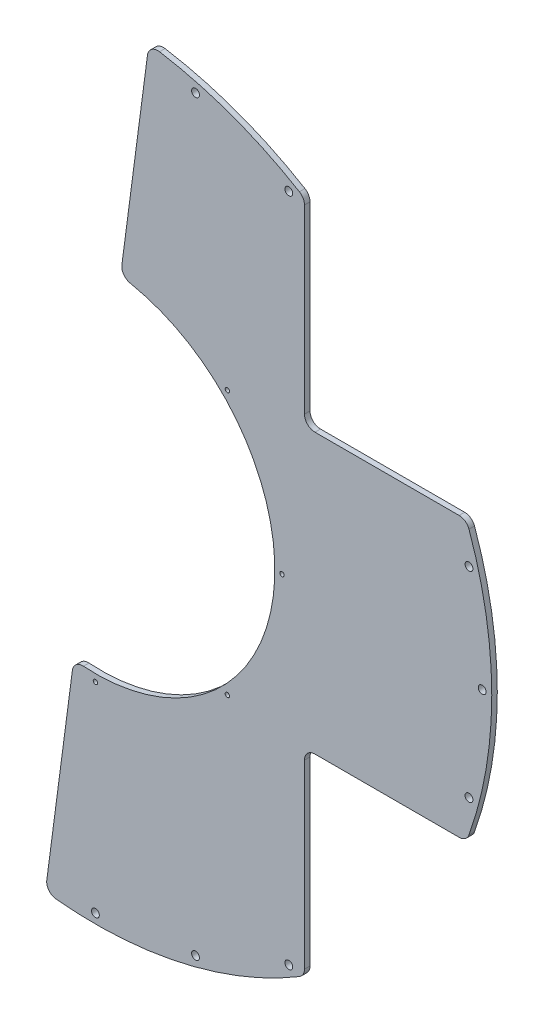
ISO-10303-21;
HEADER;
FILE_DESCRIPTION(('STEP AP214'),'2;1');
FILE_NAME('part.step','',(''),(''),'','','');
FILE_SCHEMA(('AUTOMOTIVE_DESIGN { 1 0 10303 214 1 1 1 1 }'));
ENDSEC;
DATA;
#1=APPLICATION_CONTEXT('core data for automotive mechanical design processes');
#2=APPLICATION_PROTOCOL_DEFINITION('international standard','automotive_design',2000,#1);
#3=PRODUCT_CONTEXT('',#1,'mechanical');
#4=PRODUCT('Part','Part','',(#3));
#5=PRODUCT_RELATED_PRODUCT_CATEGORY('part','',(#4));
#6=PRODUCT_DEFINITION_FORMATION('','',#4);
#7=PRODUCT_DEFINITION_CONTEXT('part definition',#1,'design');
#8=PRODUCT_DEFINITION('design','',#6,#7);
#9=PRODUCT_DEFINITION_SHAPE('','',#8);
#10=(LENGTH_UNIT() NAMED_UNIT(*) SI_UNIT(.MILLI.,.METRE.));
#11=(NAMED_UNIT(*) PLANE_ANGLE_UNIT() SI_UNIT($,.RADIAN.));
#12=(NAMED_UNIT(*) SI_UNIT($,.STERADIAN.) SOLID_ANGLE_UNIT());
#13=UNCERTAINTY_MEASURE_WITH_UNIT(LENGTH_MEASURE(1.E-05),#10,'distance_accuracy_value','');
#14=(GEOMETRIC_REPRESENTATION_CONTEXT(3) GLOBAL_UNCERTAINTY_ASSIGNED_CONTEXT((#13)) GLOBAL_UNIT_ASSIGNED_CONTEXT((#10,
#11,#12)) REPRESENTATION_CONTEXT('',''));
#15=CARTESIAN_POINT('',(0.,0.,0.));
#16=DIRECTION('',(0.,0.,1.));
#17=DIRECTION('',(1.,0.,0.));
#18=AXIS2_PLACEMENT_3D('',#15,#16,#17);
#19=CARTESIAN_POINT('',(0.,0.,3.175));
#20=DIRECTION('',(0.,0.,1.));
#21=DIRECTION('',(1.,0.,0.));
#22=AXIS2_PLACEMENT_3D('',#19,#20,#21);
#23=PLANE('',#22);
#24=CARTESIAN_POINT('',(0.,0.,3.175));
#25=DIRECTION('',(0.,0.,1.));
#26=DIRECTION('',(1.,0.,0.));
#27=AXIS2_PLACEMENT_3D('',#24,#25,#26);
#28=CIRCLE('',#27,103.);
#29=CARTESIAN_POINT('',(-6.85835625573716,-102.771411148575,3.175));
#30=VERTEX_POINT('',#29);
#31=CARTESIAN_POINT('',(19.9745350640036,101.044633449664,3.175));
#32=VERTEX_POINT('',#31);
#33=EDGE_CURVE('E221',#30,#32,#28,.T.);
#34=ORIENTED_EDGE('',*,*,#33,.F.);
#35=CARTESIAN_POINT('',(-7.25787215412961,-108.758095293152,3.175));
#36=DIRECTION('',(0.,0.,1.));
#37=DIRECTION('',(1.,0.,0.));
#38=AXIS2_PLACEMENT_3D('',#35,#36,#37);
#39=CIRCLE('',#38,6.);
#40=CARTESIAN_POINT('',(-13.2065413223725,-107.974938139832,3.175));
#41=VERTEX_POINT('',#40);
#42=EDGE_CURVE('E295',#30,#41,#39,.T.);
#43=ORIENTED_EDGE('',*,*,#42,.T.);
#44=DIRECTION('',(0.130526192220045,0.991444861373811,0.));
#45=VECTOR('',#44,1.);
#46=CARTESIAN_POINT('',(33.622992916385,247.730689151233,3.175));
#47=LINE('',#46,#45);
#48=CARTESIAN_POINT('',(-27.9056656744319,-219.625872390451,3.175));
#49=VERTEX_POINT('',#48);
#50=EDGE_CURVE('E307',#49,#41,#47,.T.);
#51=ORIENTED_EDGE('',*,*,#50,.F.);
#52=CARTESIAN_POINT('',(-21.956996506189,-220.409029543772,3.175));
#53=DIRECTION('',(0.,0.,1.));
#54=DIRECTION('',(1.,0.,0.));
#55=AXIS2_PLACEMENT_3D('',#52,#53,#54);
#56=CIRCLE('',#55,6.);
#57=CARTESIAN_POINT('',(-22.5517684205779,-226.37947729665,3.175));
#58=VERTEX_POINT('',#57);
#59=EDGE_CURVE('E245',#49,#58,#56,.T.);
#60=ORIENTED_EDGE('',*,*,#59,.T.);
#61=CARTESIAN_POINT('',(0.,0.,3.175));
#62=DIRECTION('',(0.,0.,1.));
#63=DIRECTION('',(1.,0.,0.));
#64=AXIS2_PLACEMENT_3D('',#61,#62,#63);
#65=CIRCLE('',#64,227.5);
#66=CARTESIAN_POINT('',(117.088036117381,-195.055483896697,3.175));
#67=VERTEX_POINT('',#66);
#68=EDGE_CURVE('E218',#58,#67,#65,.T.);
#69=ORIENTED_EDGE('',*,*,#68,.T.);
#70=CARTESIAN_POINT('',(114.,-189.911163442279,3.175));
#71=DIRECTION('',(0.,0.,1.));
#72=DIRECTION('',(1.,0.,0.));
#73=AXIS2_PLACEMENT_3D('',#70,#71,#72);
#74=CIRCLE('',#73,6.);
#75=CARTESIAN_POINT('',(120.,-189.911163442279,3.175));
#76=VERTEX_POINT('',#75);
#77=EDGE_CURVE('E241',#67,#76,#74,.T.);
#78=ORIENTED_EDGE('',*,*,#77,.T.);
#79=DIRECTION('',(0.,1.,0.));
#80=VECTOR('',#79,1.);
#81=CARTESIAN_POINT('',(120.,-227.5,3.175));
#82=LINE('',#81,#80);
#83=CARTESIAN_POINT('',(120.,-86.,3.175));
#84=VERTEX_POINT('',#83);
#85=EDGE_CURVE('E316',#76,#84,#82,.T.);
#86=ORIENTED_EDGE('',*,*,#85,.T.);
#87=CARTESIAN_POINT('',(126.,-86.,3.175));
#88=DIRECTION('',(0.,0.,1.));
#89=DIRECTION('',(1.,0.,0.));
#90=AXIS2_PLACEMENT_3D('',#87,#88,#89);
#91=CIRCLE('',#90,6.);
#92=CARTESIAN_POINT('',(126.,-80.,3.175));
#93=VERTEX_POINT('',#92);
#94=EDGE_CURVE('E272',#84,#93,#91,.F.);
#95=ORIENTED_EDGE('',*,*,#94,.T.);
#96=DIRECTION('',(1.,0.,0.));
#97=VECTOR('',#96,1.);
#98=CARTESIAN_POINT('',(227.5,-80.,3.175));
#99=LINE('',#98,#97);
#100=CARTESIAN_POINT('',(208.773202303361,-80.,3.175));
#101=VERTEX_POINT('',#100);
#102=EDGE_CURVE('E320',#93,#101,#99,.T.);
#103=ORIENTED_EDGE('',*,*,#102,.T.);
#104=CARTESIAN_POINT('',(208.773202303361,-74.,3.175));
#105=DIRECTION('',(0.,0.,1.));
#106=DIRECTION('',(1.,0.,0.));
#107=AXIS2_PLACEMENT_3D('',#104,#105,#106);
#108=CIRCLE('',#107,6.);
#109=CARTESIAN_POINT('',(214.428458347696,-76.0045146726863,3.175));
#110=VERTEX_POINT('',#109);
#111=EDGE_CURVE('E255',#101,#110,#108,.T.);
#112=ORIENTED_EDGE('',*,*,#111,.T.);
#113=CARTESIAN_POINT('',(214.428458347696,76.0045146726863,3.175));
#114=VERTEX_POINT('',#113);
#115=EDGE_CURVE('E214',#110,#114,#65,.T.);
#116=ORIENTED_EDGE('',*,*,#115,.T.);
#117=CARTESIAN_POINT('',(208.773202303361,74.,3.175));
#118=DIRECTION('',(0.,0.,1.));
#119=DIRECTION('',(1.,0.,0.));
#120=AXIS2_PLACEMENT_3D('',#117,#118,#119);
#121=CIRCLE('',#120,6.);
#122=CARTESIAN_POINT('',(208.773202303361,80.,3.175));
#123=VERTEX_POINT('',#122);
#124=EDGE_CURVE('E494',#114,#123,#121,.T.);
#125=ORIENTED_EDGE('',*,*,#124,.T.);
#126=DIRECTION('',(1.,0.,0.));
#127=VECTOR('',#126,1.);
#128=CARTESIAN_POINT('',(227.5,80.,3.175));
#129=LINE('',#128,#127);
#130=CARTESIAN_POINT('',(126.,80.,3.175));
#131=VERTEX_POINT('',#130);
#132=EDGE_CURVE('E328',#131,#123,#129,.T.);
#133=ORIENTED_EDGE('',*,*,#132,.F.);
#134=CARTESIAN_POINT('',(126.,86.,3.175));
#135=DIRECTION('',(0.,0.,1.));
#136=DIRECTION('',(1.,0.,0.));
#137=AXIS2_PLACEMENT_3D('',#134,#135,#136);
#138=CIRCLE('',#137,6.);
#139=CARTESIAN_POINT('',(120.,86.,3.175));
#140=VERTEX_POINT('',#139);
#141=EDGE_CURVE('E485',#131,#140,#138,.F.);
#142=ORIENTED_EDGE('',*,*,#141,.T.);
#143=DIRECTION('',(0.,-1.,0.));
#144=VECTOR('',#143,1.);
#145=CARTESIAN_POINT('',(120.,227.5,3.175));
#146=LINE('',#145,#144);
#147=CARTESIAN_POINT('',(120.,189.911163442279,3.175));
#148=VERTEX_POINT('',#147);
#149=EDGE_CURVE('E319',#148,#140,#146,.T.);
#150=ORIENTED_EDGE('',*,*,#149,.F.);
#151=CARTESIAN_POINT('',(114.,189.911163442279,3.175));
#152=DIRECTION('',(0.,0.,1.));
#153=DIRECTION('',(1.,0.,0.));
#154=AXIS2_PLACEMENT_3D('',#151,#152,#153);
#155=CIRCLE('',#154,6.);
#156=CARTESIAN_POINT('',(117.088036117381,195.055483896697,3.175));
#157=VERTEX_POINT('',#156);
#158=EDGE_CURVE('E492',#148,#157,#155,.T.);
#159=ORIENTED_EDGE('',*,*,#158,.T.);
#160=CARTESIAN_POINT('',(36.8079845987973,224.502610830642,3.175));
#161=VERTEX_POINT('',#160);
#162=EDGE_CURVE('E206',#157,#161,#65,.T.);
#163=ORIENTED_EDGE('',*,*,#162,.T.);
#164=CARTESIAN_POINT('',(35.8372245654224,218.581662852691,3.175));
#165=DIRECTION('',(0.,0.,1.));
#166=DIRECTION('',(1.,0.,0.));
#167=AXIS2_PLACEMENT_3D('',#164,#165,#166);
#168=CIRCLE('',#167,6.);
#169=CARTESIAN_POINT('',(29.8885553971795,219.364820006011,3.175));
#170=VERTEX_POINT('',#169);
#171=EDGE_CURVE('E63',#161,#170,#168,.T.);
#172=ORIENTED_EDGE('',*,*,#171,.T.);
#173=CARTESIAN_POINT('',(15.1894310451201,107.713885755391,3.175));
#174=VERTEX_POINT('',#173);
#175=EDGE_CURVE('E303',#174,#170,#47,.T.);
#176=ORIENTED_EDGE('',*,*,#175,.F.);
#177=CARTESIAN_POINT('',(21.138100213363,106.930728602071,3.175));
#178=DIRECTION('',(0.,0.,1.));
#179=DIRECTION('',(1.,0.,0.));
#180=AXIS2_PLACEMENT_3D('',#177,#178,#179);
#181=CIRCLE('',#180,6.);
#182=EDGE_CURVE('E71',#174,#32,#181,.T.);
#183=ORIENTED_EDGE('',*,*,#182,.T.);
#184=EDGE_LOOP('',(#34,#43,#51,#60,#69,#78,#86,#95,#103,#112,#116,#125,#133,#142,#150,#159,#163,
#172,#176,#183));
#185=FACE_BOUND('',#184,.T.);
#186=CARTESIAN_POINT('',(57.4578280127567,214.435533436174,3.175));
#187=DIRECTION('',(0.,0.,1.));
#188=DIRECTION('',(1.,0.,0.));
#189=AXIS2_PLACEMENT_3D('',#186,#187,#188);
#190=CIRCLE('',#189,2.24999999999999);
#191=CARTESIAN_POINT('',(59.7078280127567,214.435533436174,3.175));
#192=VERTEX_POINT('',#191);
#193=EDGE_CURVE('E331',#192,#192,#190,.T.);
#194=ORIENTED_EDGE('',*,*,#193,.F.);
#195=EDGE_LOOP('',(#194));
#196=FACE_BOUND('',#195,.T.);
#197=CARTESIAN_POINT('',(110.999999999998,192.257639640147,3.175));
#198=DIRECTION('',(0.,0.,1.));
#199=DIRECTION('',(1.,0.,0.));
#200=AXIS2_PLACEMENT_3D('',#197,#198,#199);
#201=CIRCLE('',#200,2.24999999999999);
#202=CARTESIAN_POINT('',(113.249999999998,192.257639640147,3.175));
#203=VERTEX_POINT('',#202);
#204=EDGE_CURVE('E341',#203,#203,#201,.T.);
#205=ORIENTED_EDGE('',*,*,#204,.F.);
#206=EDGE_LOOP('',(#205));
#207=FACE_BOUND('',#206,.T.);
#208=CARTESIAN_POINT('',(214.435533436173,57.457828012762,3.175));
#209=DIRECTION('',(0.,0.,1.));
#210=DIRECTION('',(1.,0.,0.));
#211=AXIS2_PLACEMENT_3D('',#208,#209,#210);
#212=CIRCLE('',#211,2.25);
#213=CARTESIAN_POINT('',(216.685533436173,57.457828012762,3.175));
#214=VERTEX_POINT('',#213);
#215=EDGE_CURVE('E347',#214,#214,#212,.T.);
#216=ORIENTED_EDGE('',*,*,#215,.F.);
#217=EDGE_LOOP('',(#216));
#218=FACE_BOUND('',#217,.T.);
#219=CARTESIAN_POINT('',(222.,2.326130119161E-12,3.175));
#220=DIRECTION('',(0.,0.,1.));
#221=DIRECTION('',(1.,0.,0.));
#222=AXIS2_PLACEMENT_3D('',#219,#220,#221);
#223=CIRCLE('',#222,2.25);
#224=CARTESIAN_POINT('',(224.25,2.326130119161E-12,3.175));
#225=VERTEX_POINT('',#224);
#226=EDGE_CURVE('E353',#225,#225,#223,.T.);
#227=ORIENTED_EDGE('',*,*,#226,.F.);
#228=EDGE_LOOP('',(#227));
#229=FACE_BOUND('',#228,.T.);
#230=CARTESIAN_POINT('',(214.435533436174,-57.4578280127575,3.175));
#231=DIRECTION('',(0.,0.,1.));
#232=DIRECTION('',(1.,0.,0.));
#233=AXIS2_PLACEMENT_3D('',#230,#231,#232);
#234=CIRCLE('',#233,2.25);
#235=CARTESIAN_POINT('',(216.685533436174,-57.4578280127575,3.175));
#236=VERTEX_POINT('',#235);
#237=EDGE_CURVE('E359',#236,#236,#234,.T.);
#238=ORIENTED_EDGE('',*,*,#237,.F.);
#239=EDGE_LOOP('',(#238));
#240=FACE_BOUND('',#239,.T.);
#241=CARTESIAN_POINT('',(111.000000000002,-192.257639640144,3.175));
#242=DIRECTION('',(0.,0.,1.));
#243=DIRECTION('',(1.,0.,0.));
#244=AXIS2_PLACEMENT_3D('',#241,#242,#243);
#245=CIRCLE('',#244,2.24999999999999);
#246=CARTESIAN_POINT('',(113.250000000002,-192.257639640144,3.175));
#247=VERTEX_POINT('',#246);
#248=EDGE_CURVE('E365',#247,#247,#245,.T.);
#249=ORIENTED_EDGE('',*,*,#248,.F.);
#250=EDGE_LOOP('',(#249));
#251=FACE_BOUND('',#250,.T.);
#252=CARTESIAN_POINT('',(57.4578280127612,-214.435533436173,3.175));
#253=DIRECTION('',(0.,0.,1.));
#254=DIRECTION('',(1.,0.,0.));
#255=AXIS2_PLACEMENT_3D('',#252,#253,#254);
#256=CIRCLE('',#255,2.24999999999999);
#257=CARTESIAN_POINT('',(59.7078280127612,-214.435533436173,3.175));
#258=VERTEX_POINT('',#257);
#259=EDGE_CURVE('E371',#258,#258,#256,.T.);
#260=ORIENTED_EDGE('',*,*,#259,.F.);
#261=EDGE_LOOP('',(#260));
#262=FACE_BOUND('',#261,.T.);
#263=CARTESIAN_POINT('',(0.,-222.,3.175));
#264=DIRECTION('',(0.,0.,1.));
#265=DIRECTION('',(1.,0.,0.));
#266=AXIS2_PLACEMENT_3D('',#263,#264,#265);
#267=CIRCLE('',#266,2.24999999999999);
#268=CARTESIAN_POINT('',(2.24999999999999,-222.,3.175));
#269=VERTEX_POINT('',#268);
#270=EDGE_CURVE('E377',#269,#269,#267,.T.);
#271=ORIENTED_EDGE('',*,*,#270,.F.);
#272=EDGE_LOOP('',(#271));
#273=FACE_BOUND('',#272,.T.);
#274=CARTESIAN_POINT('',(75.748813934608,75.7488139346098,3.175));
#275=DIRECTION('',(0.,0.,1.));
#276=DIRECTION('',(1.,0.,0.));
#277=AXIS2_PLACEMENT_3D('',#274,#275,#276);
#278=CIRCLE('',#277,1.24999999999999);
#279=CARTESIAN_POINT('',(76.998813934608,75.7488139346098,3.175));
#280=VERTEX_POINT('',#279);
#281=EDGE_CURVE('E383',#280,#280,#278,.T.);
#282=ORIENTED_EDGE('',*,*,#281,.F.);
#283=EDGE_LOOP('',(#282));
#284=FACE_BOUND('',#283,.T.);
#285=CARTESIAN_POINT('',(107.125,1.11979792121579E-12,3.175));
#286=DIRECTION('',(0.,0.,1.));
#287=DIRECTION('',(1.,0.,0.));
#288=AXIS2_PLACEMENT_3D('',#285,#286,#287);
#289=CIRCLE('',#288,1.24999999999999);
#290=CARTESIAN_POINT('',(108.375,1.11979792121579E-12,3.175));
#291=VERTEX_POINT('',#290);
#292=EDGE_CURVE('E389',#291,#291,#289,.T.);
#293=ORIENTED_EDGE('',*,*,#292,.F.);
#294=EDGE_LOOP('',(#293));
#295=FACE_BOUND('',#294,.T.);
#296=CARTESIAN_POINT('',(75.7488139346096,-75.7488139346082,3.175));
#297=DIRECTION('',(0.,0.,1.));
#298=DIRECTION('',(1.,0.,0.));
#299=AXIS2_PLACEMENT_3D('',#296,#297,#298);
#300=CIRCLE('',#299,1.24999999999999);
#301=CARTESIAN_POINT('',(76.9988139346095,-75.7488139346082,3.175));
#302=VERTEX_POINT('',#301);
#303=EDGE_CURVE('E395',#302,#302,#300,.T.);
#304=ORIENTED_EDGE('',*,*,#303,.F.);
#305=EDGE_LOOP('',(#304));
#306=FACE_BOUND('',#305,.T.);
#307=CARTESIAN_POINT('',(0.,-107.125,3.175));
#308=DIRECTION('',(0.,0.,1.));
#309=DIRECTION('',(1.,0.,0.));
#310=AXIS2_PLACEMENT_3D('',#307,#308,#309);
#311=CIRCLE('',#310,1.24999999999999);
#312=CARTESIAN_POINT('',(1.24999999999998,-107.125,3.175));
#313=VERTEX_POINT('',#312);
#314=EDGE_CURVE('E400',#313,#313,#311,.T.);
#315=ORIENTED_EDGE('',*,*,#314,.F.);
#316=EDGE_LOOP('',(#315));
#317=FACE_BOUND('',#316,.T.);
#318=ADVANCED_FACE('F48',(#185,#196,#207,#218,#229,#240,#251,#262,#273,#284,#295,#306,#317),#23,.T.);
#319=CARTESIAN_POINT('',(0.,0.,0.));
#320=DIRECTION('',(0.,0.,1.));
#321=DIRECTION('',(1.,0.,0.));
#322=AXIS2_PLACEMENT_3D('',#319,#320,#321);
#323=PLANE('',#322);
#324=CARTESIAN_POINT('',(57.4578280127567,214.435533436174,0.));
#325=DIRECTION('',(0.,0.,1.));
#326=DIRECTION('',(1.,0.,0.));
#327=AXIS2_PLACEMENT_3D('',#324,#325,#326);
#328=CIRCLE('',#327,2.25);
#329=CARTESIAN_POINT('',(59.7078280127567,214.435533436174,0.));
#330=VERTEX_POINT('',#329);
#331=EDGE_CURVE('E338',#330,#330,#328,.T.);
#332=ORIENTED_EDGE('',*,*,#331,.T.);
#333=EDGE_LOOP('',(#332));
#334=FACE_BOUND('',#333,.T.);
#335=CARTESIAN_POINT('',(110.999999999998,192.257639640147,0.));
#336=DIRECTION('',(0.,0.,1.));
#337=DIRECTION('',(1.,0.,0.));
#338=AXIS2_PLACEMENT_3D('',#335,#336,#337);
#339=CIRCLE('',#338,2.25);
#340=CARTESIAN_POINT('',(113.249999999998,192.257639640147,0.));
#341=VERTEX_POINT('',#340);
#342=EDGE_CURVE('E344',#341,#341,#339,.T.);
#343=ORIENTED_EDGE('',*,*,#342,.T.);
#344=EDGE_LOOP('',(#343));
#345=FACE_BOUND('',#344,.T.);
#346=CARTESIAN_POINT('',(214.435533436173,57.457828012762,0.));
#347=DIRECTION('',(0.,0.,1.));
#348=DIRECTION('',(1.,0.,0.));
#349=AXIS2_PLACEMENT_3D('',#346,#347,#348);
#350=CIRCLE('',#349,2.25);
#351=CARTESIAN_POINT('',(216.685533436173,57.457828012762,0.));
#352=VERTEX_POINT('',#351);
#353=EDGE_CURVE('E350',#352,#352,#350,.T.);
#354=ORIENTED_EDGE('',*,*,#353,.T.);
#355=EDGE_LOOP('',(#354));
#356=FACE_BOUND('',#355,.T.);
#357=CARTESIAN_POINT('',(222.,2.326130119161E-12,0.));
#358=DIRECTION('',(0.,0.,1.));
#359=DIRECTION('',(1.,0.,0.));
#360=AXIS2_PLACEMENT_3D('',#357,#358,#359);
#361=CIRCLE('',#360,2.25);
#362=CARTESIAN_POINT('',(224.25,2.326130119161E-12,0.));
#363=VERTEX_POINT('',#362);
#364=EDGE_CURVE('E356',#363,#363,#361,.T.);
#365=ORIENTED_EDGE('',*,*,#364,.T.);
#366=EDGE_LOOP('',(#365));
#367=FACE_BOUND('',#366,.T.);
#368=CARTESIAN_POINT('',(214.435533436174,-57.4578280127575,0.));
#369=DIRECTION('',(0.,0.,1.));
#370=DIRECTION('',(1.,0.,0.));
#371=AXIS2_PLACEMENT_3D('',#368,#369,#370);
#372=CIRCLE('',#371,2.25);
#373=CARTESIAN_POINT('',(216.685533436174,-57.4578280127575,0.));
#374=VERTEX_POINT('',#373);
#375=EDGE_CURVE('E362',#374,#374,#372,.T.);
#376=ORIENTED_EDGE('',*,*,#375,.T.);
#377=EDGE_LOOP('',(#376));
#378=FACE_BOUND('',#377,.T.);
#379=CARTESIAN_POINT('',(111.000000000002,-192.257639640144,0.));
#380=DIRECTION('',(0.,0.,1.));
#381=DIRECTION('',(1.,0.,0.));
#382=AXIS2_PLACEMENT_3D('',#379,#380,#381);
#383=CIRCLE('',#382,2.25);
#384=CARTESIAN_POINT('',(113.250000000002,-192.257639640144,0.));
#385=VERTEX_POINT('',#384);
#386=EDGE_CURVE('E368',#385,#385,#383,.T.);
#387=ORIENTED_EDGE('',*,*,#386,.T.);
#388=EDGE_LOOP('',(#387));
#389=FACE_BOUND('',#388,.T.);
#390=CARTESIAN_POINT('',(57.4578280127612,-214.435533436173,0.));
#391=DIRECTION('',(0.,0.,1.));
#392=DIRECTION('',(1.,0.,0.));
#393=AXIS2_PLACEMENT_3D('',#390,#391,#392);
#394=CIRCLE('',#393,2.25);
#395=CARTESIAN_POINT('',(59.7078280127612,-214.435533436173,0.));
#396=VERTEX_POINT('',#395);
#397=EDGE_CURVE('E374',#396,#396,#394,.T.);
#398=ORIENTED_EDGE('',*,*,#397,.T.);
#399=EDGE_LOOP('',(#398));
#400=FACE_BOUND('',#399,.T.);
#401=CARTESIAN_POINT('',(0.,-222.,0.));
#402=DIRECTION('',(0.,0.,1.));
#403=DIRECTION('',(1.,0.,0.));
#404=AXIS2_PLACEMENT_3D('',#401,#402,#403);
#405=CIRCLE('',#404,2.25);
#406=CARTESIAN_POINT('',(2.25,-222.,0.));
#407=VERTEX_POINT('',#406);
#408=EDGE_CURVE('E380',#407,#407,#405,.T.);
#409=ORIENTED_EDGE('',*,*,#408,.T.);
#410=EDGE_LOOP('',(#409));
#411=FACE_BOUND('',#410,.T.);
#412=CARTESIAN_POINT('',(75.748813934608,75.7488139346098,0.));
#413=DIRECTION('',(0.,0.,1.));
#414=DIRECTION('',(1.,0.,0.));
#415=AXIS2_PLACEMENT_3D('',#412,#413,#414);
#416=CIRCLE('',#415,1.25);
#417=CARTESIAN_POINT('',(76.998813934608,75.7488139346098,0.));
#418=VERTEX_POINT('',#417);
#419=EDGE_CURVE('E386',#418,#418,#416,.T.);
#420=ORIENTED_EDGE('',*,*,#419,.T.);
#421=EDGE_LOOP('',(#420));
#422=FACE_BOUND('',#421,.T.);
#423=CARTESIAN_POINT('',(107.125,1.11979792121579E-12,0.));
#424=DIRECTION('',(0.,0.,1.));
#425=DIRECTION('',(1.,0.,0.));
#426=AXIS2_PLACEMENT_3D('',#423,#424,#425);
#427=CIRCLE('',#426,1.25);
#428=CARTESIAN_POINT('',(108.375,1.11979792121579E-12,0.));
#429=VERTEX_POINT('',#428);
#430=EDGE_CURVE('E392',#429,#429,#427,.T.);
#431=ORIENTED_EDGE('',*,*,#430,.T.);
#432=EDGE_LOOP('',(#431));
#433=FACE_BOUND('',#432,.T.);
#434=CARTESIAN_POINT('',(75.7488139346096,-75.7488139346082,0.));
#435=DIRECTION('',(0.,0.,1.));
#436=DIRECTION('',(1.,0.,0.));
#437=AXIS2_PLACEMENT_3D('',#434,#435,#436);
#438=CIRCLE('',#437,1.25);
#439=CARTESIAN_POINT('',(76.9988139346096,-75.7488139346082,0.));
#440=VERTEX_POINT('',#439);
#441=EDGE_CURVE('E398',#440,#440,#438,.T.);
#442=ORIENTED_EDGE('',*,*,#441,.T.);
#443=EDGE_LOOP('',(#442));
#444=FACE_BOUND('',#443,.T.);
#445=CARTESIAN_POINT('',(0.,-107.125,0.));
#446=DIRECTION('',(0.,0.,1.));
#447=DIRECTION('',(1.,0.,0.));
#448=AXIS2_PLACEMENT_3D('',#445,#446,#447);
#449=CIRCLE('',#448,1.25);
#450=CARTESIAN_POINT('',(1.25,-107.125,0.));
#451=VERTEX_POINT('',#450);
#452=EDGE_CURVE('E232',#451,#451,#449,.T.);
#453=ORIENTED_EDGE('',*,*,#452,.T.);
#454=EDGE_LOOP('',(#453));
#455=FACE_BOUND('',#454,.T.);
#456=DIRECTION('',(0.130526192220045,0.991444861373811,0.));
#457=VECTOR('',#456,1.);
#458=CARTESIAN_POINT('',(33.622992916385,247.730689151233,0.));
#459=LINE('',#458,#457);
#460=CARTESIAN_POINT('',(-27.9056656744319,-219.625872390451,0.));
#461=VERTEX_POINT('',#460);
#462=CARTESIAN_POINT('',(-13.2065413223725,-107.974938139832,0.));
#463=VERTEX_POINT('',#462);
#464=EDGE_CURVE('E323',#461,#463,#459,.T.);
#465=ORIENTED_EDGE('',*,*,#464,.T.);
#466=CARTESIAN_POINT('',(-7.25787215412961,-108.758095293152,0.));
#467=DIRECTION('',(0.,0.,1.));
#468=DIRECTION('',(1.,0.,0.));
#469=AXIS2_PLACEMENT_3D('',#466,#467,#468);
#470=CIRCLE('',#469,6.);
#471=CARTESIAN_POINT('',(-6.85835625573716,-102.771411148575,0.));
#472=VERTEX_POINT('',#471);
#473=EDGE_CURVE('E286',#463,#472,#470,.F.);
#474=ORIENTED_EDGE('',*,*,#473,.T.);
#475=CARTESIAN_POINT('',(0.,0.,0.));
#476=DIRECTION('',(0.,0.,1.));
#477=DIRECTION('',(1.,0.,0.));
#478=AXIS2_PLACEMENT_3D('',#475,#476,#477);
#479=CIRCLE('',#478,103.);
#480=CARTESIAN_POINT('',(19.9745350640036,101.044633449664,0.));
#481=VERTEX_POINT('',#480);
#482=EDGE_CURVE('E227',#472,#481,#479,.T.);
#483=ORIENTED_EDGE('',*,*,#482,.T.);
#484=CARTESIAN_POINT('',(21.138100213363,106.930728602071,0.));
#485=DIRECTION('',(0.,0.,1.));
#486=DIRECTION('',(1.,0.,0.));
#487=AXIS2_PLACEMENT_3D('',#484,#485,#486);
#488=CIRCLE('',#487,6.);
#489=CARTESIAN_POINT('',(15.1894310451201,107.713885755391,0.));
#490=VERTEX_POINT('',#489);
#491=EDGE_CURVE('E281',#481,#490,#488,.F.);
#492=ORIENTED_EDGE('',*,*,#491,.T.);
#493=CARTESIAN_POINT('',(29.8885553971795,219.364820006011,0.));
#494=VERTEX_POINT('',#493);
#495=EDGE_CURVE('E305',#490,#494,#459,.T.);
#496=ORIENTED_EDGE('',*,*,#495,.T.);
#497=CARTESIAN_POINT('',(35.8372245654224,218.581662852691,0.));
#498=DIRECTION('',(0.,0.,1.));
#499=DIRECTION('',(1.,0.,0.));
#500=AXIS2_PLACEMENT_3D('',#497,#498,#499);
#501=CIRCLE('',#500,6.);
#502=CARTESIAN_POINT('',(36.8079845987973,224.502610830642,0.));
#503=VERTEX_POINT('',#502);
#504=EDGE_CURVE('E213',#494,#503,#501,.F.);
#505=ORIENTED_EDGE('',*,*,#504,.T.);
#506=CARTESIAN_POINT('',(0.,0.,0.));
#507=DIRECTION('',(0.,0.,1.));
#508=DIRECTION('',(1.,0.,0.));
#509=AXIS2_PLACEMENT_3D('',#506,#507,#508);
#510=CIRCLE('',#509,227.5);
#511=CARTESIAN_POINT('',(117.088036117381,195.055483896697,0.));
#512=VERTEX_POINT('',#511);
#513=EDGE_CURVE('E204',#512,#503,#510,.T.);
#514=ORIENTED_EDGE('',*,*,#513,.F.);
#515=CARTESIAN_POINT('',(114.,189.911163442279,0.));
#516=DIRECTION('',(0.,0.,1.));
#517=DIRECTION('',(1.,0.,0.));
#518=AXIS2_PLACEMENT_3D('',#515,#516,#517);
#519=CIRCLE('',#518,6.);
#520=CARTESIAN_POINT('',(120.,189.911163442279,0.));
#521=VERTEX_POINT('',#520);
#522=EDGE_CURVE('E186',#512,#521,#519,.F.);
#523=ORIENTED_EDGE('',*,*,#522,.T.);
#524=DIRECTION('',(0.,-1.,0.));
#525=VECTOR('',#524,1.);
#526=CARTESIAN_POINT('',(120.,227.5,0.));
#527=LINE('',#526,#525);
#528=CARTESIAN_POINT('',(120.,86.,0.));
#529=VERTEX_POINT('',#528);
#530=EDGE_CURVE('E325',#521,#529,#527,.T.);
#531=ORIENTED_EDGE('',*,*,#530,.T.);
#532=CARTESIAN_POINT('',(126.,86.,0.));
#533=DIRECTION('',(0.,0.,1.));
#534=DIRECTION('',(1.,0.,0.));
#535=AXIS2_PLACEMENT_3D('',#532,#533,#534);
#536=CIRCLE('',#535,6.);
#537=CARTESIAN_POINT('',(126.,80.,0.));
#538=VERTEX_POINT('',#537);
#539=EDGE_CURVE('E483',#529,#538,#536,.T.);
#540=ORIENTED_EDGE('',*,*,#539,.T.);
#541=DIRECTION('',(1.,0.,0.));
#542=VECTOR('',#541,1.);
#543=CARTESIAN_POINT('',(227.5,80.,0.));
#544=LINE('',#543,#542);
#545=CARTESIAN_POINT('',(208.773202303361,80.,0.));
#546=VERTEX_POINT('',#545);
#547=EDGE_CURVE('E327',#538,#546,#544,.T.);
#548=ORIENTED_EDGE('',*,*,#547,.T.);
#549=CARTESIAN_POINT('',(208.773202303361,74.,0.));
#550=DIRECTION('',(0.,0.,1.));
#551=DIRECTION('',(1.,0.,0.));
#552=AXIS2_PLACEMENT_3D('',#549,#550,#551);
#553=CIRCLE('',#552,6.);
#554=CARTESIAN_POINT('',(214.428458347696,76.0045146726863,0.));
#555=VERTEX_POINT('',#554);
#556=EDGE_CURVE('E197',#546,#555,#553,.F.);
#557=ORIENTED_EDGE('',*,*,#556,.T.);
#558=CARTESIAN_POINT('',(214.428458347696,-76.0045146726863,0.));
#559=VERTEX_POINT('',#558);
#560=EDGE_CURVE('E217',#559,#555,#510,.T.);
#561=ORIENTED_EDGE('',*,*,#560,.F.);
#562=CARTESIAN_POINT('',(208.773202303361,-74.,0.));
#563=DIRECTION('',(0.,0.,1.));
#564=DIRECTION('',(1.,0.,0.));
#565=AXIS2_PLACEMENT_3D('',#562,#563,#564);
#566=CIRCLE('',#565,6.);
#567=CARTESIAN_POINT('',(208.773202303361,-80.,0.));
#568=VERTEX_POINT('',#567);
#569=EDGE_CURVE('E475',#559,#568,#566,.F.);
#570=ORIENTED_EDGE('',*,*,#569,.T.);
#571=DIRECTION('',(1.,0.,0.));
#572=VECTOR('',#571,1.);
#573=CARTESIAN_POINT('',(227.5,-80.,0.));
#574=LINE('',#573,#572);
#575=CARTESIAN_POINT('',(126.,-80.,0.));
#576=VERTEX_POINT('',#575);
#577=EDGE_CURVE('E312',#576,#568,#574,.T.);
#578=ORIENTED_EDGE('',*,*,#577,.F.);
#579=CARTESIAN_POINT('',(126.,-86.,0.));
#580=DIRECTION('',(0.,0.,1.));
#581=DIRECTION('',(1.,0.,0.));
#582=AXIS2_PLACEMENT_3D('',#579,#580,#581);
#583=CIRCLE('',#582,6.);
#584=CARTESIAN_POINT('',(120.,-86.,0.));
#585=VERTEX_POINT('',#584);
#586=EDGE_CURVE('E274',#576,#585,#583,.T.);
#587=ORIENTED_EDGE('',*,*,#586,.T.);
#588=DIRECTION('',(0.,1.,0.));
#589=VECTOR('',#588,1.);
#590=CARTESIAN_POINT('',(120.,-227.5,0.));
#591=LINE('',#590,#589);
#592=CARTESIAN_POINT('',(120.,-189.911163442279,0.));
#593=VERTEX_POINT('',#592);
#594=EDGE_CURVE('E315',#593,#585,#591,.T.);
#595=ORIENTED_EDGE('',*,*,#594,.F.);
#596=CARTESIAN_POINT('',(114.,-189.911163442279,0.));
#597=DIRECTION('',(0.,0.,1.));
#598=DIRECTION('',(1.,0.,0.));
#599=AXIS2_PLACEMENT_3D('',#596,#597,#598);
#600=CIRCLE('',#599,6.);
#601=CARTESIAN_POINT('',(117.088036117381,-195.055483896697,0.));
#602=VERTEX_POINT('',#601);
#603=EDGE_CURVE('E256',#593,#602,#600,.F.);
#604=ORIENTED_EDGE('',*,*,#603,.T.);
#605=CARTESIAN_POINT('',(-22.5517684205779,-226.37947729665,0.));
#606=VERTEX_POINT('',#605);
#607=EDGE_CURVE('E215',#606,#602,#510,.T.);
#608=ORIENTED_EDGE('',*,*,#607,.F.);
#609=CARTESIAN_POINT('',(-21.956996506189,-220.409029543772,0.));
#610=DIRECTION('',(0.,0.,1.));
#611=DIRECTION('',(1.,0.,0.));
#612=AXIS2_PLACEMENT_3D('',#609,#610,#611);
#613=CIRCLE('',#612,6.);
#614=EDGE_CURVE('E284',#606,#461,#613,.F.);
#615=ORIENTED_EDGE('',*,*,#614,.T.);
#616=EDGE_LOOP('',(#465,#474,#483,#492,#496,#505,#514,#523,#531,#540,#548,#557,#561,#570,#578,
#587,#595,#604,#608,#615));
#617=FACE_BOUND('',#616,.T.);
#618=ADVANCED_FACE('F210',(#334,#345,#356,#367,#378,#389,#400,#411,#422,#433,#444,#455,#617),
#323,.F.);
#619=CARTESIAN_POINT('',(0.,0.,3.175));
#620=DIRECTION('',(0.,0.,-1.));
#621=DIRECTION('',(-1.,0.,0.));
#622=AXIS2_PLACEMENT_3D('',#619,#620,#621);
#623=CYLINDRICAL_SURFACE('',#622,227.5);
#624=ORIENTED_EDGE('',*,*,#68,.F.);
#625=DIRECTION('',(0.,0.,-1.));
#626=VECTOR('',#625,1.);
#627=CARTESIAN_POINT('',(-22.5517684205779,-226.37947729665,3.175));
#628=LINE('',#627,#626);
#629=EDGE_CURVE('E297',#58,#606,#628,.T.);
#630=ORIENTED_EDGE('',*,*,#629,.T.);
#631=ORIENTED_EDGE('',*,*,#607,.T.);
#632=DIRECTION('',(0.,0.,-1.));
#633=VECTOR('',#632,1.);
#634=CARTESIAN_POINT('',(117.088036117381,-195.055483896697,3.175));
#635=LINE('',#634,#633);
#636=EDGE_CURVE('E250',#602,#67,#635,.F.);
#637=ORIENTED_EDGE('',*,*,#636,.T.);
#638=EDGE_LOOP('',(#624,#630,#631,#637));
#639=FACE_BOUND('',#638,.T.);
#640=ADVANCED_FACE('F251',(#639),#623,.T.);
#641=ORIENTED_EDGE('',*,*,#115,.F.);
#642=DIRECTION('',(0.,0.,-1.));
#643=VECTOR('',#642,1.);
#644=CARTESIAN_POINT('',(214.428458347696,-76.0045146726863,3.175));
#645=LINE('',#644,#643);
#646=EDGE_CURVE('E270',#110,#559,#645,.T.);
#647=ORIENTED_EDGE('',*,*,#646,.T.);
#648=ORIENTED_EDGE('',*,*,#560,.T.);
#649=DIRECTION('',(0.,0.,-1.));
#650=VECTOR('',#649,1.);
#651=CARTESIAN_POINT('',(214.428458347696,76.0045146726863,3.175));
#652=LINE('',#651,#650);
#653=EDGE_CURVE('E207',#555,#114,#652,.F.);
#654=ORIENTED_EDGE('',*,*,#653,.T.);
#655=EDGE_LOOP('',(#641,#647,#648,#654));
#656=FACE_BOUND('',#655,.T.);
#657=ADVANCED_FACE('F431',(#656),#623,.T.);
#658=ORIENTED_EDGE('',*,*,#513,.T.);
#659=DIRECTION('',(0.,0.,-1.));
#660=VECTOR('',#659,1.);
#661=CARTESIAN_POINT('',(36.8079845987973,224.502610830642,3.175));
#662=LINE('',#661,#660);
#663=EDGE_CURVE('E299',#503,#161,#662,.F.);
#664=ORIENTED_EDGE('',*,*,#663,.T.);
#665=ORIENTED_EDGE('',*,*,#162,.F.);
#666=DIRECTION('',(0.,0.,-1.));
#667=VECTOR('',#666,1.);
#668=CARTESIAN_POINT('',(117.088036117381,195.055483896697,3.175));
#669=LINE('',#668,#667);
#670=EDGE_CURVE('E190',#157,#512,#669,.T.);
#671=ORIENTED_EDGE('',*,*,#670,.T.);
#672=EDGE_LOOP('',(#658,#664,#665,#671));
#673=FACE_BOUND('',#672,.T.);
#674=ADVANCED_FACE('F202',(#673),#623,.T.);
#675=CARTESIAN_POINT('',(0.,0.,3.175));
#676=DIRECTION('',(0.,0.,-1.));
#677=DIRECTION('',(-1.,0.,0.));
#678=AXIS2_PLACEMENT_3D('',#675,#676,#677);
#679=CYLINDRICAL_SURFACE('',#678,103.);
#680=ORIENTED_EDGE('',*,*,#482,.F.);
#681=DIRECTION('',(0.,0.,-1.));
#682=VECTOR('',#681,1.);
#683=CARTESIAN_POINT('',(-6.85835625573716,-102.771411148575,3.175));
#684=LINE('',#683,#682);
#685=EDGE_CURVE('E290',#472,#30,#684,.F.);
#686=ORIENTED_EDGE('',*,*,#685,.T.);
#687=ORIENTED_EDGE('',*,*,#33,.T.);
#688=DIRECTION('',(0.,0.,-1.));
#689=VECTOR('',#688,1.);
#690=CARTESIAN_POINT('',(19.9745350640036,101.044633449664,3.175));
#691=LINE('',#690,#689);
#692=EDGE_CURVE('E288',#32,#481,#691,.T.);
#693=ORIENTED_EDGE('',*,*,#692,.T.);
#694=EDGE_LOOP('',(#680,#686,#687,#693));
#695=FACE_BOUND('',#694,.T.);
#696=ADVANCED_FACE('F411',(#695),#679,.F.);
#697=CARTESIAN_POINT('',(0.,-107.125,3.175));
#698=DIRECTION('',(0.,0.,1.));
#699=DIRECTION('',(1.,0.,0.));
#700=AXIS2_PLACEMENT_3D('',#697,#698,#699);
#701=CYLINDRICAL_SURFACE('',#700,1.24999999999999);
#702=ORIENTED_EDGE('',*,*,#452,.F.);
#703=EDGE_LOOP('',(#702));
#704=FACE_BOUND('',#703,.T.);
#705=ORIENTED_EDGE('',*,*,#314,.T.);
#706=EDGE_LOOP('',(#705));
#707=FACE_BOUND('',#706,.T.);
#708=ADVANCED_FACE('F408',(#704,#707),#701,.F.);
#709=CARTESIAN_POINT('',(75.7488139346096,-75.7488139346082,3.175));
#710=DIRECTION('',(0.,0.,1.));
#711=DIRECTION('',(1.,0.,0.));
#712=AXIS2_PLACEMENT_3D('',#709,#710,#711);
#713=CYLINDRICAL_SURFACE('',#712,1.24999999999999);
#714=ORIENTED_EDGE('',*,*,#441,.F.);
#715=EDGE_LOOP('',(#714));
#716=FACE_BOUND('',#715,.T.);
#717=ORIENTED_EDGE('',*,*,#303,.T.);
#718=EDGE_LOOP('',(#717));
#719=FACE_BOUND('',#718,.T.);
#720=ADVANCED_FACE('F410',(#716,#719),#713,.F.);
#721=CARTESIAN_POINT('',(107.125,1.11979792121579E-12,3.175));
#722=DIRECTION('',(0.,0.,1.));
#723=DIRECTION('',(1.,0.,0.));
#724=AXIS2_PLACEMENT_3D('',#721,#722,#723);
#725=CYLINDRICAL_SURFACE('',#724,1.24999999999999);
#726=ORIENTED_EDGE('',*,*,#430,.F.);
#727=EDGE_LOOP('',(#726));
#728=FACE_BOUND('',#727,.T.);
#729=ORIENTED_EDGE('',*,*,#292,.T.);
#730=EDGE_LOOP('',(#729));
#731=FACE_BOUND('',#730,.T.);
#732=ADVANCED_FACE('F417',(#728,#731),#725,.F.);
#733=CARTESIAN_POINT('',(75.748813934608,75.7488139346098,3.175));
#734=DIRECTION('',(0.,0.,1.));
#735=DIRECTION('',(1.,0.,0.));
#736=AXIS2_PLACEMENT_3D('',#733,#734,#735);
#737=CYLINDRICAL_SURFACE('',#736,1.24999999999999);
#738=ORIENTED_EDGE('',*,*,#419,.F.);
#739=EDGE_LOOP('',(#738));
#740=FACE_BOUND('',#739,.T.);
#741=ORIENTED_EDGE('',*,*,#281,.T.);
#742=EDGE_LOOP('',(#741));
#743=FACE_BOUND('',#742,.T.);
#744=ADVANCED_FACE('F560',(#740,#743),#737,.F.);
#745=CARTESIAN_POINT('',(0.,-222.,3.175));
#746=DIRECTION('',(0.,0.,1.));
#747=DIRECTION('',(1.,0.,0.));
#748=AXIS2_PLACEMENT_3D('',#745,#746,#747);
#749=CYLINDRICAL_SURFACE('',#748,2.24999999999999);
#750=ORIENTED_EDGE('',*,*,#408,.F.);
#751=EDGE_LOOP('',(#750));
#752=FACE_BOUND('',#751,.T.);
#753=ORIENTED_EDGE('',*,*,#270,.T.);
#754=EDGE_LOOP('',(#753));
#755=FACE_BOUND('',#754,.T.);
#756=ADVANCED_FACE('F556',(#752,#755),#749,.F.);
#757=CARTESIAN_POINT('',(57.4578280127612,-214.435533436173,3.175));
#758=DIRECTION('',(0.,0.,1.));
#759=DIRECTION('',(1.,0.,0.));
#760=AXIS2_PLACEMENT_3D('',#757,#758,#759);
#761=CYLINDRICAL_SURFACE('',#760,2.25);
#762=ORIENTED_EDGE('',*,*,#397,.F.);
#763=EDGE_LOOP('',(#762));
#764=FACE_BOUND('',#763,.T.);
#765=ORIENTED_EDGE('',*,*,#259,.T.);
#766=EDGE_LOOP('',(#765));
#767=FACE_BOUND('',#766,.T.);
#768=ADVANCED_FACE('F552',(#764,#767),#761,.F.);
#769=CARTESIAN_POINT('',(111.000000000002,-192.257639640144,3.175));
#770=DIRECTION('',(0.,0.,1.));
#771=DIRECTION('',(1.,0.,0.));
#772=AXIS2_PLACEMENT_3D('',#769,#770,#771);
#773=CYLINDRICAL_SURFACE('',#772,2.25);
#774=ORIENTED_EDGE('',*,*,#386,.F.);
#775=EDGE_LOOP('',(#774));
#776=FACE_BOUND('',#775,.T.);
#777=ORIENTED_EDGE('',*,*,#248,.T.);
#778=EDGE_LOOP('',(#777));
#779=FACE_BOUND('',#778,.T.);
#780=ADVANCED_FACE('F548',(#776,#779),#773,.F.);
#781=CARTESIAN_POINT('',(214.435533436174,-57.4578280127575,3.175));
#782=DIRECTION('',(0.,0.,1.));
#783=DIRECTION('',(1.,0.,0.));
#784=AXIS2_PLACEMENT_3D('',#781,#782,#783);
#785=CYLINDRICAL_SURFACE('',#784,2.25);
#786=ORIENTED_EDGE('',*,*,#375,.F.);
#787=EDGE_LOOP('',(#786));
#788=FACE_BOUND('',#787,.T.);
#789=ORIENTED_EDGE('',*,*,#237,.T.);
#790=EDGE_LOOP('',(#789));
#791=FACE_BOUND('',#790,.T.);
#792=ADVANCED_FACE('F544',(#788,#791),#785,.F.);
#793=CARTESIAN_POINT('',(222.,2.326130119161E-12,3.175));
#794=DIRECTION('',(0.,0.,1.));
#795=DIRECTION('',(1.,0.,0.));
#796=AXIS2_PLACEMENT_3D('',#793,#794,#795);
#797=CYLINDRICAL_SURFACE('',#796,2.25);
#798=ORIENTED_EDGE('',*,*,#364,.F.);
#799=EDGE_LOOP('',(#798));
#800=FACE_BOUND('',#799,.T.);
#801=ORIENTED_EDGE('',*,*,#226,.T.);
#802=EDGE_LOOP('',(#801));
#803=FACE_BOUND('',#802,.T.);
#804=ADVANCED_FACE('F540',(#800,#803),#797,.F.);
#805=CARTESIAN_POINT('',(214.435533436173,57.457828012762,3.175));
#806=DIRECTION('',(0.,0.,1.));
#807=DIRECTION('',(1.,0.,0.));
#808=AXIS2_PLACEMENT_3D('',#805,#806,#807);
#809=CYLINDRICAL_SURFACE('',#808,2.25);
#810=ORIENTED_EDGE('',*,*,#353,.F.);
#811=EDGE_LOOP('',(#810));
#812=FACE_BOUND('',#811,.T.);
#813=ORIENTED_EDGE('',*,*,#215,.T.);
#814=EDGE_LOOP('',(#813));
#815=FACE_BOUND('',#814,.T.);
#816=ADVANCED_FACE('F536',(#812,#815),#809,.F.);
#817=CARTESIAN_POINT('',(110.999999999998,192.257639640147,3.175));
#818=DIRECTION('',(0.,0.,1.));
#819=DIRECTION('',(1.,0.,0.));
#820=AXIS2_PLACEMENT_3D('',#817,#818,#819);
#821=CYLINDRICAL_SURFACE('',#820,2.25);
#822=ORIENTED_EDGE('',*,*,#342,.F.);
#823=EDGE_LOOP('',(#822));
#824=FACE_BOUND('',#823,.T.);
#825=ORIENTED_EDGE('',*,*,#204,.T.);
#826=EDGE_LOOP('',(#825));
#827=FACE_BOUND('',#826,.T.);
#828=ADVANCED_FACE('F532',(#824,#827),#821,.F.);
#829=CARTESIAN_POINT('',(57.4578280127567,214.435533436174,3.175));
#830=DIRECTION('',(0.,0.,1.));
#831=DIRECTION('',(1.,0.,0.));
#832=AXIS2_PLACEMENT_3D('',#829,#830,#831);
#833=CYLINDRICAL_SURFACE('',#832,2.25);
#834=ORIENTED_EDGE('',*,*,#331,.F.);
#835=EDGE_LOOP('',(#834));
#836=FACE_BOUND('',#835,.T.);
#837=ORIENTED_EDGE('',*,*,#193,.T.);
#838=EDGE_LOOP('',(#837));
#839=FACE_BOUND('',#838,.T.);
#840=ADVANCED_FACE('F525',(#836,#839),#833,.F.);
#841=CARTESIAN_POINT('',(227.5,80.,0.));
#842=DIRECTION('',(0.,-1.,0.));
#843=DIRECTION('',(1.,0.,0.));
#844=AXIS2_PLACEMENT_3D('',#841,#842,#843);
#845=PLANE('',#844);
#846=ORIENTED_EDGE('',*,*,#132,.T.);
#847=DIRECTION('',(0.,0.,-1.));
#848=VECTOR('',#847,1.);
#849=CARTESIAN_POINT('',(208.773202303361,80.,0.));
#850=LINE('',#849,#848);
#851=EDGE_CURVE('E487',#123,#546,#850,.T.);
#852=ORIENTED_EDGE('',*,*,#851,.T.);
#853=ORIENTED_EDGE('',*,*,#547,.F.);
#854=DIRECTION('',(0.,0.,1.));
#855=VECTOR('',#854,1.);
#856=CARTESIAN_POINT('',(126.,80.,3.175));
#857=LINE('',#856,#855);
#858=EDGE_CURVE('E489',#538,#131,#857,.T.);
#859=ORIENTED_EDGE('',*,*,#858,.T.);
#860=EDGE_LOOP('',(#846,#852,#853,#859));
#861=FACE_BOUND('',#860,.T.);
#862=ADVANCED_FACE('F522',(#861),#845,.F.);
#863=CARTESIAN_POINT('',(120.,227.5,0.));
#864=DIRECTION('',(-1.,0.,0.));
#865=DIRECTION('',(0.,-1.,0.));
#866=AXIS2_PLACEMENT_3D('',#863,#864,#865);
#867=PLANE('',#866);
#868=ORIENTED_EDGE('',*,*,#530,.F.);
#869=DIRECTION('',(0.,0.,-1.));
#870=VECTOR('',#869,1.);
#871=CARTESIAN_POINT('',(120.,189.911163442279,0.));
#872=LINE('',#871,#870);
#873=EDGE_CURVE('E191',#521,#148,#872,.F.);
#874=ORIENTED_EDGE('',*,*,#873,.T.);
#875=ORIENTED_EDGE('',*,*,#149,.T.);
#876=DIRECTION('',(0.,0.,1.));
#877=VECTOR('',#876,1.);
#878=CARTESIAN_POINT('',(120.,86.,0.));
#879=LINE('',#878,#877);
#880=EDGE_CURVE('E196',#140,#529,#879,.F.);
#881=ORIENTED_EDGE('',*,*,#880,.T.);
#882=EDGE_LOOP('',(#868,#874,#875,#881));
#883=FACE_BOUND('',#882,.T.);
#884=ADVANCED_FACE('F435',(#883),#867,.F.);
#885=CARTESIAN_POINT('',(114.,189.911163442279,3.175));
#886=DIRECTION('',(0.,0.,-1.));
#887=DIRECTION('',(-1.,0.,0.));
#888=AXIS2_PLACEMENT_3D('',#885,#886,#887);
#889=CYLINDRICAL_SURFACE('',#888,6.);
#890=ORIENTED_EDGE('',*,*,#158,.F.);
#891=ORIENTED_EDGE('',*,*,#873,.F.);
#892=ORIENTED_EDGE('',*,*,#522,.F.);
#893=ORIENTED_EDGE('',*,*,#670,.F.);
#894=EDGE_LOOP('',(#890,#891,#892,#893));
#895=FACE_BOUND('',#894,.T.);
#896=ADVANCED_FACE('F189',(#895),#889,.T.);
#897=CARTESIAN_POINT('',(208.773202303361,74.,3.175));
#898=DIRECTION('',(0.,0.,-1.));
#899=DIRECTION('',(-1.,0.,0.));
#900=AXIS2_PLACEMENT_3D('',#897,#898,#899);
#901=CYLINDRICAL_SURFACE('',#900,6.);
#902=ORIENTED_EDGE('',*,*,#556,.F.);
#903=ORIENTED_EDGE('',*,*,#851,.F.);
#904=ORIENTED_EDGE('',*,*,#124,.F.);
#905=ORIENTED_EDGE('',*,*,#653,.F.);
#906=EDGE_LOOP('',(#902,#903,#904,#905));
#907=FACE_BOUND('',#906,.T.);
#908=ADVANCED_FACE('F434',(#907),#901,.T.);
#909=CARTESIAN_POINT('',(126.,86.,0.));
#910=DIRECTION('',(0.,0.,-1.));
#911=DIRECTION('',(-1.,0.,0.));
#912=AXIS2_PLACEMENT_3D('',#909,#910,#911);
#913=CYLINDRICAL_SURFACE('',#912,6.);
#914=ORIENTED_EDGE('',*,*,#539,.F.);
#915=ORIENTED_EDGE('',*,*,#880,.F.);
#916=ORIENTED_EDGE('',*,*,#141,.F.);
#917=ORIENTED_EDGE('',*,*,#858,.F.);
#918=EDGE_LOOP('',(#914,#915,#916,#917));
#919=FACE_BOUND('',#918,.T.);
#920=ADVANCED_FACE('F438',(#919),#913,.F.);
#921=CARTESIAN_POINT('',(120.,-227.5,0.));
#922=DIRECTION('',(1.,0.,0.));
#923=DIRECTION('',(0.,1.,0.));
#924=AXIS2_PLACEMENT_3D('',#921,#922,#923);
#925=PLANE('',#924);
#926=ORIENTED_EDGE('',*,*,#85,.F.);
#927=DIRECTION('',(0.,0.,1.));
#928=VECTOR('',#927,1.);
#929=CARTESIAN_POINT('',(120.,-189.911163442279,0.));
#930=LINE('',#929,#928);
#931=EDGE_CURVE('E261',#76,#593,#930,.F.);
#932=ORIENTED_EDGE('',*,*,#931,.T.);
#933=ORIENTED_EDGE('',*,*,#594,.T.);
#934=DIRECTION('',(0.,0.,1.));
#935=VECTOR('',#934,1.);
#936=CARTESIAN_POINT('',(120.,-86.,3.175));
#937=LINE('',#936,#935);
#938=EDGE_CURVE('E480',#585,#84,#937,.T.);
#939=ORIENTED_EDGE('',*,*,#938,.T.);
#940=EDGE_LOOP('',(#926,#932,#933,#939));
#941=FACE_BOUND('',#940,.T.);
#942=ADVANCED_FACE('F442',(#941),#925,.T.);
#943=CARTESIAN_POINT('',(227.5,-80.,0.));
#944=DIRECTION('',(0.,-1.,0.));
#945=DIRECTION('',(1.,0.,0.));
#946=AXIS2_PLACEMENT_3D('',#943,#944,#945);
#947=PLANE('',#946);
#948=ORIENTED_EDGE('',*,*,#577,.T.);
#949=DIRECTION('',(0.,0.,1.));
#950=VECTOR('',#949,1.);
#951=CARTESIAN_POINT('',(208.773202303361,-80.,3.175));
#952=LINE('',#951,#950);
#953=EDGE_CURVE('E264',#568,#101,#952,.T.);
#954=ORIENTED_EDGE('',*,*,#953,.T.);
#955=ORIENTED_EDGE('',*,*,#102,.F.);
#956=DIRECTION('',(0.,0.,1.));
#957=VECTOR('',#956,1.);
#958=CARTESIAN_POINT('',(126.,-80.,0.));
#959=LINE('',#958,#957);
#960=EDGE_CURVE('E262',#93,#576,#959,.F.);
#961=ORIENTED_EDGE('',*,*,#960,.T.);
#962=EDGE_LOOP('',(#948,#954,#955,#961));
#963=FACE_BOUND('',#962,.T.);
#964=ADVANCED_FACE('F447',(#963),#947,.T.);
#965=CARTESIAN_POINT('',(114.,-189.911163442279,3.175));
#966=DIRECTION('',(0.,0.,-1.));
#967=DIRECTION('',(-1.,0.,0.));
#968=AXIS2_PLACEMENT_3D('',#965,#966,#967);
#969=CYLINDRICAL_SURFACE('',#968,6.);
#970=ORIENTED_EDGE('',*,*,#77,.F.);
#971=ORIENTED_EDGE('',*,*,#636,.F.);
#972=ORIENTED_EDGE('',*,*,#603,.F.);
#973=ORIENTED_EDGE('',*,*,#931,.F.);
#974=EDGE_LOOP('',(#970,#971,#972,#973));
#975=FACE_BOUND('',#974,.T.);
#976=ADVANCED_FACE('F259',(#975),#969,.T.);
#977=CARTESIAN_POINT('',(208.773202303361,-74.,3.175));
#978=DIRECTION('',(0.,0.,-1.));
#979=DIRECTION('',(-1.,0.,0.));
#980=AXIS2_PLACEMENT_3D('',#977,#978,#979);
#981=CYLINDRICAL_SURFACE('',#980,6.);
#982=ORIENTED_EDGE('',*,*,#569,.F.);
#983=ORIENTED_EDGE('',*,*,#646,.F.);
#984=ORIENTED_EDGE('',*,*,#111,.F.);
#985=ORIENTED_EDGE('',*,*,#953,.F.);
#986=EDGE_LOOP('',(#982,#983,#984,#985));
#987=FACE_BOUND('',#986,.T.);
#988=ADVANCED_FACE('F446',(#987),#981,.T.);
#989=CARTESIAN_POINT('',(126.,-86.,0.));
#990=DIRECTION('',(0.,0.,-1.));
#991=DIRECTION('',(-1.,0.,0.));
#992=AXIS2_PLACEMENT_3D('',#989,#990,#991);
#993=CYLINDRICAL_SURFACE('',#992,6.);
#994=ORIENTED_EDGE('',*,*,#586,.F.);
#995=ORIENTED_EDGE('',*,*,#960,.F.);
#996=ORIENTED_EDGE('',*,*,#94,.F.);
#997=ORIENTED_EDGE('',*,*,#938,.F.);
#998=EDGE_LOOP('',(#994,#995,#996,#997));
#999=FACE_BOUND('',#998,.T.);
#1000=ADVANCED_FACE('F450',(#999),#993,.F.);
#1001=CARTESIAN_POINT('',(33.622992916385,247.730689151233,0.));
#1002=DIRECTION('',(0.991444861373811,-0.130526192220045,0.));
#1003=DIRECTION('',(0.130526192220045,0.991444861373811,0.));
#1004=AXIS2_PLACEMENT_3D('',#1001,#1002,#1003);
#1005=PLANE('',#1004);
#1006=ORIENTED_EDGE('',*,*,#175,.T.);
#1007=DIRECTION('',(0.,0.,-1.));
#1008=VECTOR('',#1007,1.);
#1009=CARTESIAN_POINT('',(29.8885553971795,219.364820006011,0.));
#1010=LINE('',#1009,#1008);
#1011=EDGE_CURVE('E13',#170,#494,#1010,.T.);
#1012=ORIENTED_EDGE('',*,*,#1011,.T.);
#1013=ORIENTED_EDGE('',*,*,#495,.F.);
#1014=DIRECTION('',(0.,0.,1.));
#1015=VECTOR('',#1014,1.);
#1016=CARTESIAN_POINT('',(15.1894310451201,107.713885755392,3.175));
#1017=LINE('',#1016,#1015);
#1018=EDGE_CURVE('E56',#490,#174,#1017,.T.);
#1019=ORIENTED_EDGE('',*,*,#1018,.T.);
#1020=EDGE_LOOP('',(#1006,#1012,#1013,#1019));
#1021=FACE_BOUND('',#1020,.T.);
#1022=ADVANCED_FACE('F302',(#1021),#1005,.F.);
#1023=ORIENTED_EDGE('',*,*,#50,.T.);
#1024=DIRECTION('',(0.,0.,1.));
#1025=VECTOR('',#1024,1.);
#1026=CARTESIAN_POINT('',(-13.2065413223725,-107.974938139832,0.));
#1027=LINE('',#1026,#1025);
#1028=EDGE_CURVE('E278',#41,#463,#1027,.F.);
#1029=ORIENTED_EDGE('',*,*,#1028,.T.);
#1030=ORIENTED_EDGE('',*,*,#464,.F.);
#1031=DIRECTION('',(0.,0.,-1.));
#1032=VECTOR('',#1031,1.);
#1033=CARTESIAN_POINT('',(-27.9056656744319,-219.625872390451,0.));
#1034=LINE('',#1033,#1032);
#1035=EDGE_CURVE('E276',#461,#49,#1034,.F.);
#1036=ORIENTED_EDGE('',*,*,#1035,.T.);
#1037=EDGE_LOOP('',(#1023,#1029,#1030,#1036));
#1038=FACE_BOUND('',#1037,.T.);
#1039=ADVANCED_FACE('F459',(#1038),#1005,.F.);
#1040=CARTESIAN_POINT('',(-7.25787215412961,-108.758095293152,3.175));
#1041=DIRECTION('',(0.,0.,-1.));
#1042=DIRECTION('',(-1.,0.,0.));
#1043=AXIS2_PLACEMENT_3D('',#1040,#1041,#1042);
#1044=CYLINDRICAL_SURFACE('',#1043,6.);
#1045=ORIENTED_EDGE('',*,*,#42,.F.);
#1046=ORIENTED_EDGE('',*,*,#685,.F.);
#1047=ORIENTED_EDGE('',*,*,#473,.F.);
#1048=ORIENTED_EDGE('',*,*,#1028,.F.);
#1049=EDGE_LOOP('',(#1045,#1046,#1047,#1048));
#1050=FACE_BOUND('',#1049,.T.);
#1051=ADVANCED_FACE('F455',(#1050),#1044,.T.);
#1052=CARTESIAN_POINT('',(-21.956996506189,-220.409029543772,3.175));
#1053=DIRECTION('',(0.,0.,-1.));
#1054=DIRECTION('',(-1.,0.,0.));
#1055=AXIS2_PLACEMENT_3D('',#1052,#1053,#1054);
#1056=CYLINDRICAL_SURFACE('',#1055,6.);
#1057=ORIENTED_EDGE('',*,*,#59,.F.);
#1058=ORIENTED_EDGE('',*,*,#1035,.F.);
#1059=ORIENTED_EDGE('',*,*,#614,.F.);
#1060=ORIENTED_EDGE('',*,*,#629,.F.);
#1061=EDGE_LOOP('',(#1057,#1058,#1059,#1060));
#1062=FACE_BOUND('',#1061,.T.);
#1063=ADVANCED_FACE('F458',(#1062),#1056,.T.);
#1064=CARTESIAN_POINT('',(35.8372245654224,218.581662852691,3.175));
#1065=DIRECTION('',(0.,0.,-1.));
#1066=DIRECTION('',(-1.,0.,0.));
#1067=AXIS2_PLACEMENT_3D('',#1064,#1065,#1066);
#1068=CYLINDRICAL_SURFACE('',#1067,6.);
#1069=ORIENTED_EDGE('',*,*,#504,.F.);
#1070=ORIENTED_EDGE('',*,*,#1011,.F.);
#1071=ORIENTED_EDGE('',*,*,#171,.F.);
#1072=ORIENTED_EDGE('',*,*,#663,.F.);
#1073=EDGE_LOOP('',(#1069,#1070,#1071,#1072));
#1074=FACE_BOUND('',#1073,.T.);
#1075=ADVANCED_FACE('F462',(#1074),#1068,.T.);
#1076=CARTESIAN_POINT('',(21.138100213363,106.930728602071,3.175));
#1077=DIRECTION('',(0.,0.,-1.));
#1078=DIRECTION('',(-1.,0.,0.));
#1079=AXIS2_PLACEMENT_3D('',#1076,#1077,#1078);
#1080=CYLINDRICAL_SURFACE('',#1079,6.);
#1081=ORIENTED_EDGE('',*,*,#491,.F.);
#1082=ORIENTED_EDGE('',*,*,#692,.F.);
#1083=ORIENTED_EDGE('',*,*,#182,.F.);
#1084=ORIENTED_EDGE('',*,*,#1018,.F.);
#1085=EDGE_LOOP('',(#1081,#1082,#1083,#1084));
#1086=FACE_BOUND('',#1085,.T.);
#1087=ADVANCED_FACE('F50',(#1086),#1080,.T.);
#1088=CLOSED_SHELL('',(#318,#618,#640,#657,#674,#696,#708,#720,#732,#744,#756,#768,#780,#792,
#804,#816,#828,#840,#862,#884,#896,#908,#920,#942,#964,#976,#988,#1000,#1022,#1039,#1051,#1063,
#1075,#1087));
#1089=MANIFOLD_SOLID_BREP('B2',#1088);
#1090=ADVANCED_BREP_SHAPE_REPRESENTATION('',(#18,#1089),#14);
#1091=SHAPE_DEFINITION_REPRESENTATION(#9,#1090);
ENDSEC;
END-ISO-10303-21;
